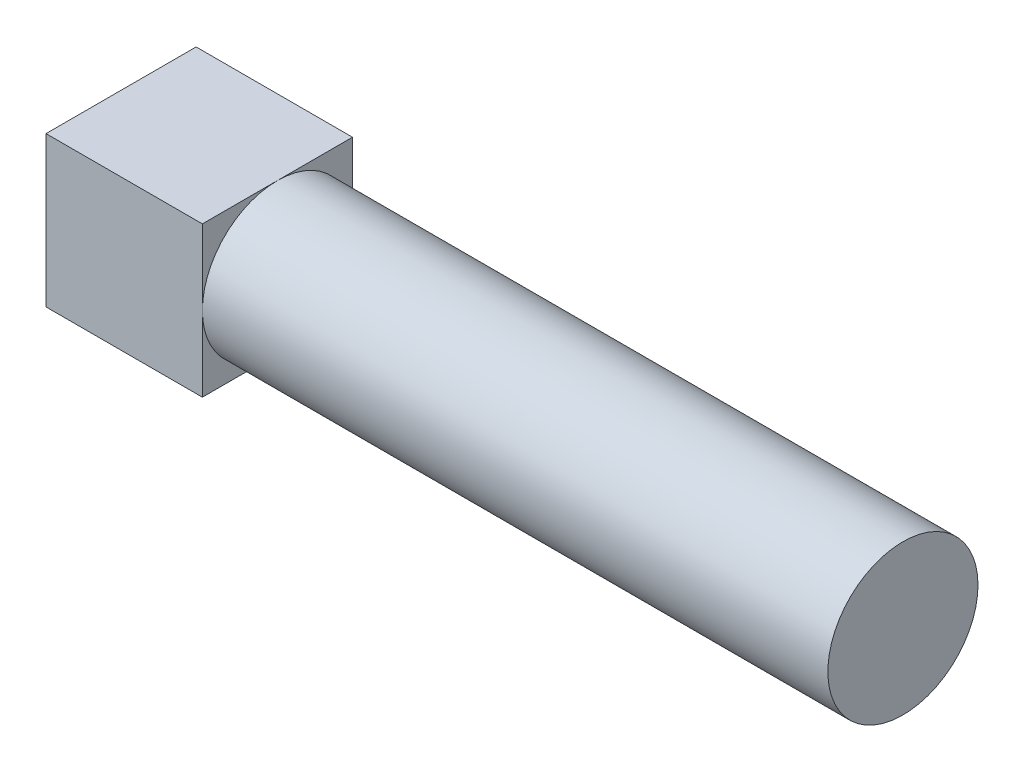
ISO-10303-21;
HEADER;
FILE_DESCRIPTION(('STEP AP214'),'2;1');
FILE_NAME('part.step','',(''),(''),'','','');
FILE_SCHEMA(('AUTOMOTIVE_DESIGN { 1 0 10303 214 1 1 1 1 }'));
ENDSEC;
DATA;
#1=APPLICATION_CONTEXT('core data for automotive mechanical design processes');
#2=APPLICATION_PROTOCOL_DEFINITION('international standard','automotive_design',2000,#1);
#3=PRODUCT_CONTEXT('',#1,'mechanical');
#4=PRODUCT('Part','Part','',(#3));
#5=PRODUCT_RELATED_PRODUCT_CATEGORY('part','',(#4));
#6=PRODUCT_DEFINITION_FORMATION('','',#4);
#7=PRODUCT_DEFINITION_CONTEXT('part definition',#1,'design');
#8=PRODUCT_DEFINITION('design','',#6,#7);
#9=PRODUCT_DEFINITION_SHAPE('','',#8);
#10=(LENGTH_UNIT() NAMED_UNIT(*) SI_UNIT(.MILLI.,.METRE.));
#11=(NAMED_UNIT(*) PLANE_ANGLE_UNIT() SI_UNIT($,.RADIAN.));
#12=(NAMED_UNIT(*) SI_UNIT($,.STERADIAN.) SOLID_ANGLE_UNIT());
#13=UNCERTAINTY_MEASURE_WITH_UNIT(LENGTH_MEASURE(1.E-05),#10,'distance_accuracy_value','');
#14=(GEOMETRIC_REPRESENTATION_CONTEXT(3) GLOBAL_UNCERTAINTY_ASSIGNED_CONTEXT((#13)) GLOBAL_UNIT_ASSIGNED_CONTEXT((#10,
#11,#12)) REPRESENTATION_CONTEXT('',''));
#15=CARTESIAN_POINT('',(0.,0.,0.));
#16=DIRECTION('',(0.,0.,1.));
#17=DIRECTION('',(1.,0.,0.));
#18=AXIS2_PLACEMENT_3D('',#15,#16,#17);
#19=CARTESIAN_POINT('',(10.,0.,0.));
#20=DIRECTION('',(1.,0.,0.));
#21=DIRECTION('',(0.,0.,-1.));
#22=AXIS2_PLACEMENT_3D('',#19,#20,#21);
#23=PLANE('',#22);
#24=CARTESIAN_POINT('',(10.,0.,0.));
#25=DIRECTION('',(1.,0.,0.));
#26=DIRECTION('',(0.,0.,-1.));
#27=AXIS2_PLACEMENT_3D('',#24,#25,#26);
#28=CIRCLE('',#27,4.8);
#29=CARTESIAN_POINT('',(10.,0.,-4.8));
#30=VERTEX_POINT('',#29);
#31=CARTESIAN_POINT('',(10.,4.8,0.));
#32=VERTEX_POINT('',#31);
#33=EDGE_CURVE('E53',#30,#32,#28,.T.);
#34=ORIENTED_EDGE('',*,*,#33,.F.);
#35=DIRECTION('',(0.,1.,0.));
#36=VECTOR('',#35,1.);
#37=CARTESIAN_POINT('',(10.,4.8,-4.8));
#38=LINE('',#37,#36);
#39=CARTESIAN_POINT('',(10.,4.8,-4.8));
#40=VERTEX_POINT('',#39);
#41=EDGE_CURVE('E105',#30,#40,#38,.T.);
#42=ORIENTED_EDGE('',*,*,#41,.T.);
#43=DIRECTION('',(0.,0.,1.));
#44=VECTOR('',#43,1.);
#45=CARTESIAN_POINT('',(10.,4.8,4.8));
#46=LINE('',#45,#44);
#47=EDGE_CURVE('E117',#40,#32,#46,.T.);
#48=ORIENTED_EDGE('',*,*,#47,.T.);
#49=EDGE_LOOP('',(#34,#42,#48));
#50=FACE_BOUND('',#49,.T.);
#51=ADVANCED_FACE('F41',(#50),#23,.T.);
#52=CARTESIAN_POINT('',(10.,0.,4.8));
#53=VERTEX_POINT('',#52);
#54=EDGE_CURVE('E11',#32,#53,#28,.T.);
#55=ORIENTED_EDGE('',*,*,#54,.F.);
#56=CARTESIAN_POINT('',(10.,4.8,4.8));
#57=VERTEX_POINT('',#56);
#58=EDGE_CURVE('E104',#32,#57,#46,.T.);
#59=ORIENTED_EDGE('',*,*,#58,.T.);
#60=DIRECTION('',(0.,-1.,0.));
#61=VECTOR('',#60,1.);
#62=CARTESIAN_POINT('',(10.,4.8,4.8));
#63=LINE('',#62,#61);
#64=EDGE_CURVE('E131',#57,#53,#63,.T.);
#65=ORIENTED_EDGE('',*,*,#64,.T.);
#66=EDGE_LOOP('',(#55,#59,#65));
#67=FACE_BOUND('',#66,.T.);
#68=ADVANCED_FACE('F174',(#67),#23,.T.);
#69=CARTESIAN_POINT('',(10.,-4.8,0.));
#70=VERTEX_POINT('',#69);
#71=EDGE_CURVE('E51',#53,#70,#28,.T.);
#72=ORIENTED_EDGE('',*,*,#71,.F.);
#73=CARTESIAN_POINT('',(10.,-4.8,4.8));
#74=VERTEX_POINT('',#73);
#75=EDGE_CURVE('E130',#53,#74,#63,.T.);
#76=ORIENTED_EDGE('',*,*,#75,.T.);
#77=DIRECTION('',(0.,0.,-1.));
#78=VECTOR('',#77,1.);
#79=CARTESIAN_POINT('',(10.,-4.8,4.8));
#80=LINE('',#79,#78);
#81=EDGE_CURVE('E135',#74,#70,#80,.T.);
#82=ORIENTED_EDGE('',*,*,#81,.T.);
#83=EDGE_LOOP('',(#72,#76,#82));
#84=FACE_BOUND('',#83,.T.);
#85=ADVANCED_FACE('F195',(#84),#23,.T.);
#86=CARTESIAN_POINT('',(10.,4.8,-4.8));
#87=DIRECTION('',(0.,0.,1.));
#88=DIRECTION('',(0.,-1.,0.));
#89=AXIS2_PLACEMENT_3D('',#86,#87,#88);
#90=PLANE('',#89);
#91=DIRECTION('',(0.,1.,0.));
#92=VECTOR('',#91,1.);
#93=CARTESIAN_POINT('',(0.,4.8,-4.8));
#94=LINE('',#93,#92);
#95=CARTESIAN_POINT('',(0.,-4.8,-4.8));
#96=VERTEX_POINT('',#95);
#97=CARTESIAN_POINT('',(0.,4.8,-4.8));
#98=VERTEX_POINT('',#97);
#99=EDGE_CURVE('E139',#96,#98,#94,.T.);
#100=ORIENTED_EDGE('',*,*,#99,.T.);
#101=DIRECTION('',(-1.,0.,0.));
#102=VECTOR('',#101,1.);
#103=CARTESIAN_POINT('',(10.,4.8,-4.8));
#104=LINE('',#103,#102);
#105=EDGE_CURVE('E45',#40,#98,#104,.T.);
#106=ORIENTED_EDGE('',*,*,#105,.F.);
#107=ORIENTED_EDGE('',*,*,#41,.F.);
#108=CARTESIAN_POINT('',(10.,-4.8,-4.8));
#109=VERTEX_POINT('',#108);
#110=EDGE_CURVE('E96',#109,#30,#38,.T.);
#111=ORIENTED_EDGE('',*,*,#110,.F.);
#112=DIRECTION('',(-1.,0.,0.));
#113=VECTOR('',#112,1.);
#114=CARTESIAN_POINT('',(10.,-4.8,-4.8));
#115=LINE('',#114,#113);
#116=EDGE_CURVE('E138',#109,#96,#115,.T.);
#117=ORIENTED_EDGE('',*,*,#116,.T.);
#118=EDGE_LOOP('',(#100,#106,#107,#111,#117));
#119=FACE_BOUND('',#118,.T.);
#120=ADVANCED_FACE('F43',(#119),#90,.F.);
#121=CARTESIAN_POINT('',(10.,4.8,4.8));
#122=DIRECTION('',(0.,-1.,0.));
#123=DIRECTION('',(0.,0.,-1.));
#124=AXIS2_PLACEMENT_3D('',#121,#122,#123);
#125=PLANE('',#124);
#126=DIRECTION('',(0.,0.,1.));
#127=VECTOR('',#126,1.);
#128=CARTESIAN_POINT('',(0.,4.8,4.8));
#129=LINE('',#128,#127);
#130=CARTESIAN_POINT('',(0.,4.8,4.8));
#131=VERTEX_POINT('',#130);
#132=EDGE_CURVE('E142',#98,#131,#129,.T.);
#133=ORIENTED_EDGE('',*,*,#132,.T.);
#134=DIRECTION('',(-1.,0.,0.));
#135=VECTOR('',#134,1.);
#136=CARTESIAN_POINT('',(10.,4.8,4.8));
#137=LINE('',#136,#135);
#138=EDGE_CURVE('E125',#57,#131,#137,.T.);
#139=ORIENTED_EDGE('',*,*,#138,.F.);
#140=ORIENTED_EDGE('',*,*,#58,.F.);
#141=ORIENTED_EDGE('',*,*,#47,.F.);
#142=ORIENTED_EDGE('',*,*,#105,.T.);
#143=EDGE_LOOP('',(#133,#139,#140,#141,#142));
#144=FACE_BOUND('',#143,.T.);
#145=ADVANCED_FACE('F205',(#144),#125,.F.);
#146=CARTESIAN_POINT('',(10.,4.8,4.8));
#147=DIRECTION('',(0.,0.,-1.));
#148=DIRECTION('',(0.,1.,0.));
#149=AXIS2_PLACEMENT_3D('',#146,#147,#148);
#150=PLANE('',#149);
#151=DIRECTION('',(0.,-1.,0.));
#152=VECTOR('',#151,1.);
#153=CARTESIAN_POINT('',(0.,4.8,4.8));
#154=LINE('',#153,#152);
#155=CARTESIAN_POINT('',(0.,-4.8,4.8));
#156=VERTEX_POINT('',#155);
#157=EDGE_CURVE('E145',#131,#156,#154,.T.);
#158=ORIENTED_EDGE('',*,*,#157,.T.);
#159=DIRECTION('',(-1.,0.,0.));
#160=VECTOR('',#159,1.);
#161=CARTESIAN_POINT('',(10.,-4.8,4.8));
#162=LINE('',#161,#160);
#163=EDGE_CURVE('E152',#74,#156,#162,.T.);
#164=ORIENTED_EDGE('',*,*,#163,.F.);
#165=ORIENTED_EDGE('',*,*,#75,.F.);
#166=ORIENTED_EDGE('',*,*,#64,.F.);
#167=ORIENTED_EDGE('',*,*,#138,.T.);
#168=EDGE_LOOP('',(#158,#164,#165,#166,#167));
#169=FACE_BOUND('',#168,.T.);
#170=ADVANCED_FACE('F161',(#169),#150,.F.);
#171=CARTESIAN_POINT('',(10.,-4.8,4.8));
#172=DIRECTION('',(0.,1.,0.));
#173=DIRECTION('',(0.,0.,1.));
#174=AXIS2_PLACEMENT_3D('',#171,#172,#173);
#175=PLANE('',#174);
#176=DIRECTION('',(0.,0.,-1.));
#177=VECTOR('',#176,1.);
#178=CARTESIAN_POINT('',(0.,-4.8,4.8));
#179=LINE('',#178,#177);
#180=EDGE_CURVE('E115',#156,#96,#179,.T.);
#181=ORIENTED_EDGE('',*,*,#180,.T.);
#182=ORIENTED_EDGE('',*,*,#116,.F.);
#183=EDGE_CURVE('E99',#70,#109,#80,.T.);
#184=ORIENTED_EDGE('',*,*,#183,.F.);
#185=ORIENTED_EDGE('',*,*,#81,.F.);
#186=ORIENTED_EDGE('',*,*,#163,.T.);
#187=EDGE_LOOP('',(#181,#182,#184,#185,#186));
#188=FACE_BOUND('',#187,.T.);
#189=ADVANCED_FACE('F170',(#188),#175,.F.);
#190=EDGE_CURVE('E60',#70,#30,#28,.T.);
#191=ORIENTED_EDGE('',*,*,#190,.F.);
#192=ORIENTED_EDGE('',*,*,#183,.T.);
#193=ORIENTED_EDGE('',*,*,#110,.T.);
#194=EDGE_LOOP('',(#191,#192,#193));
#195=FACE_BOUND('',#194,.T.);
#196=ADVANCED_FACE('F98',(#195),#23,.T.);
#197=CARTESIAN_POINT('',(0.,0.,0.));
#198=DIRECTION('',(1.,0.,0.));
#199=DIRECTION('',(0.,0.,-1.));
#200=AXIS2_PLACEMENT_3D('',#197,#198,#199);
#201=PLANE('',#200);
#202=ORIENTED_EDGE('',*,*,#99,.F.);
#203=ORIENTED_EDGE('',*,*,#180,.F.);
#204=ORIENTED_EDGE('',*,*,#157,.F.);
#205=ORIENTED_EDGE('',*,*,#132,.F.);
#206=EDGE_LOOP('',(#202,#203,#204,#205));
#207=FACE_BOUND('',#206,.T.);
#208=ADVANCED_FACE('F168',(#207),#201,.F.);
#209=CARTESIAN_POINT('',(50.,0.,0.));
#210=DIRECTION('',(-1.,0.,0.));
#211=DIRECTION('',(0.,0.,1.));
#212=AXIS2_PLACEMENT_3D('',#209,#210,#211);
#213=CYLINDRICAL_SURFACE('',#212,4.8);
#214=CARTESIAN_POINT('',(50.,0.,0.));
#215=DIRECTION('',(1.,0.,0.));
#216=DIRECTION('',(0.,0.,-1.));
#217=AXIS2_PLACEMENT_3D('',#214,#215,#216);
#218=CIRCLE('',#217,4.8);
#219=CARTESIAN_POINT('',(50.,0.,-4.8));
#220=VERTEX_POINT('',#219);
#221=EDGE_CURVE('E120',#220,#220,#218,.T.);
#222=ORIENTED_EDGE('',*,*,#221,.F.);
#223=EDGE_LOOP('',(#222));
#224=FACE_BOUND('',#223,.T.);
#225=ORIENTED_EDGE('',*,*,#33,.T.);
#226=ORIENTED_EDGE('',*,*,#54,.T.);
#227=ORIENTED_EDGE('',*,*,#71,.T.);
#228=ORIENTED_EDGE('',*,*,#190,.T.);
#229=EDGE_LOOP('',(#225,#226,#227,#228));
#230=FACE_BOUND('',#229,.T.);
#231=ADVANCED_FACE('F121',(#224,#230),#213,.T.);
#232=CARTESIAN_POINT('',(50.,0.,0.));
#233=DIRECTION('',(1.,0.,0.));
#234=DIRECTION('',(0.,0.,-1.));
#235=AXIS2_PLACEMENT_3D('',#232,#233,#234);
#236=PLANE('',#235);
#237=ORIENTED_EDGE('',*,*,#221,.T.);
#238=EDGE_LOOP('',(#237));
#239=FACE_BOUND('',#238,.T.);
#240=ADVANCED_FACE('F180',(#239),#236,.T.);
#241=CLOSED_SHELL('',(#51,#68,#85,#120,#145,#170,#189,#196,#208,#231,#240));
#242=MANIFOLD_SOLID_BREP('B2',#241);
#243=ADVANCED_BREP_SHAPE_REPRESENTATION('',(#18,#242),#14);
#244=SHAPE_DEFINITION_REPRESENTATION(#9,#243);
ENDSEC;
END-ISO-10303-21;
